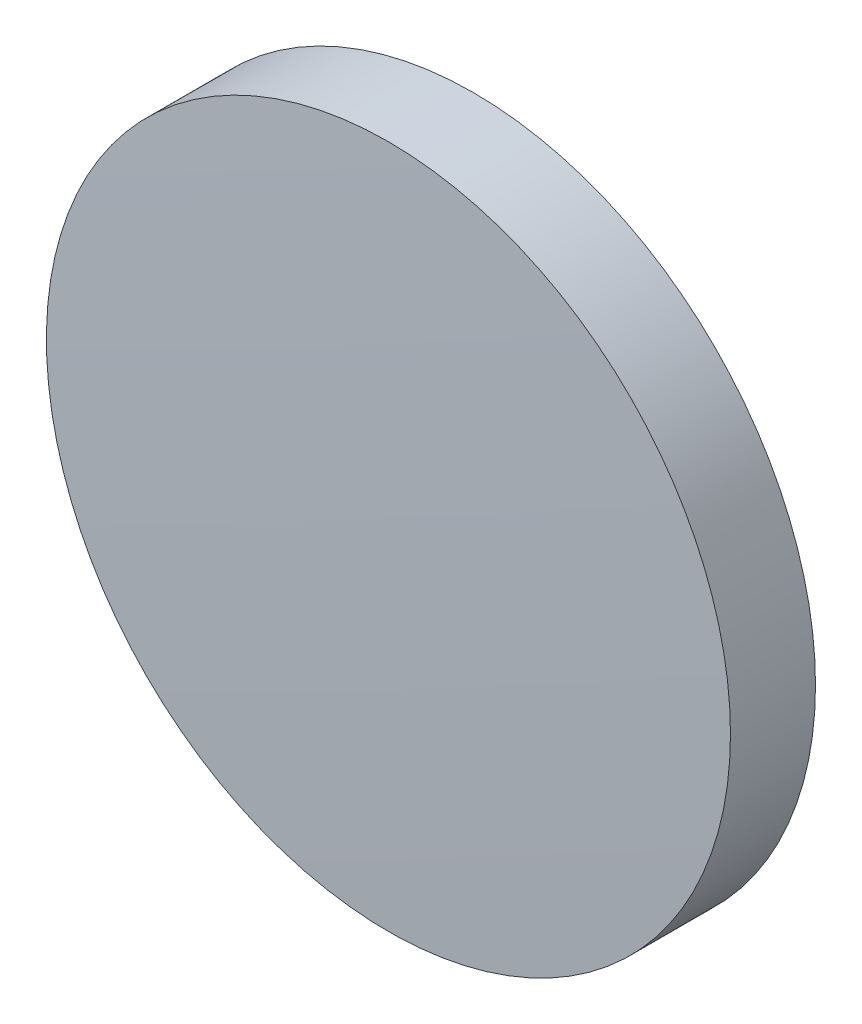
ISO-10303-21;
HEADER;
FILE_DESCRIPTION(('STEP AP214'),'2;1');
FILE_NAME('part.step','',(''),(''),'','','');
FILE_SCHEMA(('AUTOMOTIVE_DESIGN { 1 0 10303 214 1 1 1 1 }'));
ENDSEC;
DATA;
#1=APPLICATION_CONTEXT('core data for automotive mechanical design processes');
#2=APPLICATION_PROTOCOL_DEFINITION('international standard','automotive_design',2000,#1);
#3=PRODUCT_CONTEXT('',#1,'mechanical');
#4=PRODUCT('Part','Part','',(#3));
#5=PRODUCT_RELATED_PRODUCT_CATEGORY('part','',(#4));
#6=PRODUCT_DEFINITION_FORMATION('','',#4);
#7=PRODUCT_DEFINITION_CONTEXT('part definition',#1,'design');
#8=PRODUCT_DEFINITION('design','',#6,#7);
#9=PRODUCT_DEFINITION_SHAPE('','',#8);
#10=(LENGTH_UNIT() NAMED_UNIT(*) SI_UNIT(.MILLI.,.METRE.));
#11=(NAMED_UNIT(*) PLANE_ANGLE_UNIT() SI_UNIT($,.RADIAN.));
#12=(NAMED_UNIT(*) SI_UNIT($,.STERADIAN.) SOLID_ANGLE_UNIT());
#13=UNCERTAINTY_MEASURE_WITH_UNIT(LENGTH_MEASURE(1.E-05),#10,'distance_accuracy_value','');
#14=(GEOMETRIC_REPRESENTATION_CONTEXT(3) GLOBAL_UNCERTAINTY_ASSIGNED_CONTEXT((#13)) GLOBAL_UNIT_ASSIGNED_CONTEXT((#10,
#11,#12)) REPRESENTATION_CONTEXT('',''));
#15=CARTESIAN_POINT('',(0.,0.,0.));
#16=DIRECTION('',(0.,0.,1.));
#17=DIRECTION('',(1.,0.,0.));
#18=AXIS2_PLACEMENT_3D('',#15,#16,#17);
#19=CARTESIAN_POINT('',(0.,0.,-498.340641830142));
#20=DIRECTION('',(0.,0.,1.));
#21=DIRECTION('',(0.,1.,0.));
#22=AXIS2_PLACEMENT_3D('',#19,#20,#21);
#23=SPHERICAL_SURFACE('',#22,500.);
#24=CARTESIAN_POINT('',(0.,0.,1.4980421469986));
#25=DIRECTION('',(0.,0.,1.));
#26=DIRECTION('',(1.,0.,0.));
#27=AXIS2_PLACEMENT_3D('',#24,#25,#26);
#28=CIRCLE('',#27,12.7);
#29=CARTESIAN_POINT('',(12.7,0.,1.4980421469986));
#30=VERTEX_POINT('',#29);
#31=EDGE_CURVE('E8',#30,#30,#28,.T.);
#32=ORIENTED_EDGE('',*,*,#31,.T.);
#33=EDGE_LOOP('',(#32));
#34=FACE_BOUND('',#33,.T.);
#35=ADVANCED_FACE('F12',(#34),#23,.T.);
#36=CARTESIAN_POINT('',(0.,0.,9.06446192469888));
#37=DIRECTION('',(0.,0.,1.));
#38=DIRECTION('',(1.,0.,0.));
#39=AXIS2_PLACEMENT_3D('',#36,#37,#38);
#40=CYLINDRICAL_SURFACE('',#39,12.7);
#41=ORIENTED_EDGE('',*,*,#31,.F.);
#42=EDGE_LOOP('',(#41));
#43=FACE_BOUND('',#42,.T.);
#44=CARTESIAN_POINT('',(0.,0.,-1.65935816985782));
#45=DIRECTION('',(0.,0.,1.));
#46=DIRECTION('',(1.,0.,0.));
#47=AXIS2_PLACEMENT_3D('',#44,#45,#46);
#48=CIRCLE('',#47,12.7);
#49=CARTESIAN_POINT('',(12.7,0.,-1.65935816985782));
#50=VERTEX_POINT('',#49);
#51=EDGE_CURVE('E18',#50,#50,#48,.T.);
#52=ORIENTED_EDGE('',*,*,#51,.T.);
#53=EDGE_LOOP('',(#52));
#54=FACE_BOUND('',#53,.T.);
#55=ADVANCED_FACE('F24',(#43,#54),#40,.T.);
#56=CARTESIAN_POINT('',(0.,0.,-254.530641830142));
#57=DIRECTION('',(0.,0.,1.));
#58=DIRECTION('',(0.,1.,0.));
#59=AXIS2_PLACEMENT_3D('',#56,#57,#58);
#60=SPHERICAL_SURFACE('',#59,253.19);
#61=ORIENTED_EDGE('',*,*,#51,.F.);
#62=EDGE_LOOP('',(#61));
#63=FACE_BOUND('',#62,.T.);
#64=ADVANCED_FACE('F26',(#63),#60,.F.);
#65=CLOSED_SHELL('',(#35,#55,#64));
#66=MANIFOLD_SOLID_BREP('B1',#65);
#67=ADVANCED_BREP_SHAPE_REPRESENTATION('',(#18,#66),#14);
#68=SHAPE_DEFINITION_REPRESENTATION(#9,#67);
ENDSEC;
END-ISO-10303-21;
